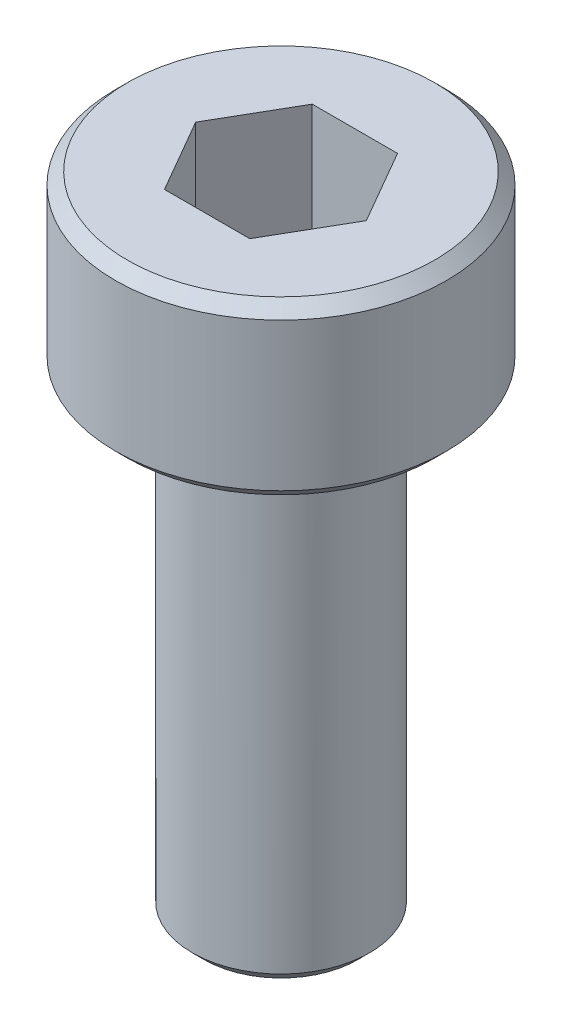
ISO-10303-21;
HEADER;
FILE_DESCRIPTION(('STEP AP214'),'2;1');
FILE_NAME('part.step','',(''),(''),'','','');
FILE_SCHEMA(('AUTOMOTIVE_DESIGN { 1 0 10303 214 1 1 1 1 }'));
ENDSEC;
DATA;
#1=APPLICATION_CONTEXT('core data for automotive mechanical design processes');
#2=APPLICATION_PROTOCOL_DEFINITION('international standard','automotive_design',2000,#1);
#3=PRODUCT_CONTEXT('',#1,'mechanical');
#4=PRODUCT('Part','Part','',(#3));
#5=PRODUCT_RELATED_PRODUCT_CATEGORY('part','',(#4));
#6=PRODUCT_DEFINITION_FORMATION('','',#4);
#7=PRODUCT_DEFINITION_CONTEXT('part definition',#1,'design');
#8=PRODUCT_DEFINITION('design','',#6,#7);
#9=PRODUCT_DEFINITION_SHAPE('','',#8);
#10=(LENGTH_UNIT() NAMED_UNIT(*) SI_UNIT(.MILLI.,.METRE.));
#11=(NAMED_UNIT(*) PLANE_ANGLE_UNIT() SI_UNIT($,.RADIAN.));
#12=(NAMED_UNIT(*) SI_UNIT($,.STERADIAN.) SOLID_ANGLE_UNIT());
#13=UNCERTAINTY_MEASURE_WITH_UNIT(LENGTH_MEASURE(1.E-05),#10,'distance_accuracy_value','');
#14=(GEOMETRIC_REPRESENTATION_CONTEXT(3) GLOBAL_UNCERTAINTY_ASSIGNED_CONTEXT((#13)) GLOBAL_UNIT_ASSIGNED_CONTEXT((#10,
#11,#12)) REPRESENTATION_CONTEXT('',''));
#15=CARTESIAN_POINT('',(0.,0.,0.));
#16=DIRECTION('',(0.,0.,1.));
#17=DIRECTION('',(1.,0.,0.));
#18=AXIS2_PLACEMENT_3D('',#15,#16,#17);
#19=CARTESIAN_POINT('',(0.721687836487033,8.9,1.25));
#20=DIRECTION('',(0.866025403784439,0.,0.5));
#21=DIRECTION('',(0.5,0.,-0.866025403784439));
#22=AXIS2_PLACEMENT_3D('',#19,#20,#21);
#23=PLANE('',#22);
#24=DIRECTION('',(0.5,0.,-0.866025403784439));
#25=VECTOR('',#24,1.);
#26=CARTESIAN_POINT('',(0.721687836487033,8.9,1.25));
#27=LINE('',#26,#25);
#28=CARTESIAN_POINT('',(0.721687836487033,8.9,1.25));
#29=VERTEX_POINT('',#28);
#30=CARTESIAN_POINT('',(1.44337567297407,8.9,0.));
#31=VERTEX_POINT('',#30);
#32=EDGE_CURVE('E66',#29,#31,#27,.T.);
#33=ORIENTED_EDGE('',*,*,#32,.F.);
#34=DIRECTION('',(0.,1.,0.));
#35=VECTOR('',#34,1.);
#36=CARTESIAN_POINT('',(0.721687836487033,8.9,1.25));
#37=LINE('',#36,#35);
#38=CARTESIAN_POINT('',(0.721687836487033,10.9,1.25));
#39=VERTEX_POINT('',#38);
#40=EDGE_CURVE('E86',#29,#39,#37,.T.);
#41=ORIENTED_EDGE('',*,*,#40,.T.);
#42=DIRECTION('',(0.5,0.,-0.866025403784439));
#43=VECTOR('',#42,1.);
#44=CARTESIAN_POINT('',(0.721687836487033,10.9,1.25));
#45=LINE('',#44,#43);
#46=CARTESIAN_POINT('',(1.44337567297406,10.9,0.));
#47=VERTEX_POINT('',#46);
#48=EDGE_CURVE('E74',#47,#39,#45,.F.);
#49=ORIENTED_EDGE('',*,*,#48,.F.);
#50=DIRECTION('',(0.,1.,0.));
#51=VECTOR('',#50,1.);
#52=CARTESIAN_POINT('',(1.44337567297406,8.9,0.));
#53=LINE('',#52,#51);
#54=EDGE_CURVE('E81',#47,#31,#53,.F.);
#55=ORIENTED_EDGE('',*,*,#54,.T.);
#56=EDGE_LOOP('',(#33,#41,#49,#55));
#57=FACE_BOUND('',#56,.T.);
#58=ADVANCED_FACE('F17',(#57),#23,.F.);
#59=CARTESIAN_POINT('',(1.44337567297406,8.9,0.));
#60=DIRECTION('',(0.866025403784438,0.,-0.5));
#61=DIRECTION('',(-0.5,0.,-0.866025403784438));
#62=AXIS2_PLACEMENT_3D('',#59,#60,#61);
#63=PLANE('',#62);
#64=DIRECTION('',(-0.5,0.,-0.866025403784438));
#65=VECTOR('',#64,1.);
#66=CARTESIAN_POINT('',(1.44337567297406,8.9,0.));
#67=LINE('',#66,#65);
#68=CARTESIAN_POINT('',(0.721687836487032,8.9,-1.25));
#69=VERTEX_POINT('',#68);
#70=EDGE_CURVE('E90',#31,#69,#67,.T.);
#71=ORIENTED_EDGE('',*,*,#70,.F.);
#72=ORIENTED_EDGE('',*,*,#54,.F.);
#73=DIRECTION('',(-0.5,0.,-0.866025403784438));
#74=VECTOR('',#73,1.);
#75=CARTESIAN_POINT('',(1.44337567297406,10.9,0.));
#76=LINE('',#75,#74);
#77=CARTESIAN_POINT('',(0.721687836487032,10.9,-1.25));
#78=VERTEX_POINT('',#77);
#79=EDGE_CURVE('E70',#78,#47,#76,.F.);
#80=ORIENTED_EDGE('',*,*,#79,.F.);
#81=DIRECTION('',(0.,1.,0.));
#82=VECTOR('',#81,1.);
#83=CARTESIAN_POINT('',(0.721687836487032,8.9,-1.25));
#84=LINE('',#83,#82);
#85=EDGE_CURVE('E134',#78,#69,#84,.F.);
#86=ORIENTED_EDGE('',*,*,#85,.T.);
#87=EDGE_LOOP('',(#71,#72,#80,#86));
#88=FACE_BOUND('',#87,.T.);
#89=ADVANCED_FACE('F89',(#88),#63,.F.);
#90=CARTESIAN_POINT('',(-0.721687836487032,8.9,1.25));
#91=DIRECTION('',(0.,0.,1.));
#92=DIRECTION('',(1.,0.,0.));
#93=AXIS2_PLACEMENT_3D('',#90,#91,#92);
#94=PLANE('',#93);
#95=DIRECTION('',(1.,0.,0.));
#96=VECTOR('',#95,1.);
#97=CARTESIAN_POINT('',(1.44337567297406,8.9,1.25));
#98=LINE('',#97,#96);
#99=CARTESIAN_POINT('',(-0.721687836487032,8.9,1.25));
#100=VERTEX_POINT('',#99);
#101=EDGE_CURVE('E132',#100,#29,#98,.T.);
#102=ORIENTED_EDGE('',*,*,#101,.F.);
#103=DIRECTION('',(0.,1.,0.));
#104=VECTOR('',#103,1.);
#105=CARTESIAN_POINT('',(-0.721687836487032,8.9,1.25));
#106=LINE('',#105,#104);
#107=CARTESIAN_POINT('',(-0.721687836487032,10.9,1.25));
#108=VERTEX_POINT('',#107);
#109=EDGE_CURVE('E122',#100,#108,#106,.T.);
#110=ORIENTED_EDGE('',*,*,#109,.T.);
#111=DIRECTION('',(1.,0.,0.));
#112=VECTOR('',#111,1.);
#113=CARTESIAN_POINT('',(-0.721687836487032,10.9,1.25));
#114=LINE('',#113,#112);
#115=EDGE_CURVE('E92',#39,#108,#114,.F.);
#116=ORIENTED_EDGE('',*,*,#115,.F.);
#117=ORIENTED_EDGE('',*,*,#40,.F.);
#118=EDGE_LOOP('',(#102,#110,#116,#117));
#119=FACE_BOUND('',#118,.T.);
#120=ADVANCED_FACE('F139',(#119),#94,.F.);
#121=CARTESIAN_POINT('',(0.721687836487032,8.9,-1.25));
#122=DIRECTION('',(0.,0.,-1.));
#123=DIRECTION('',(-1.,0.,0.));
#124=AXIS2_PLACEMENT_3D('',#121,#122,#123);
#125=PLANE('',#124);
#126=DIRECTION('',(1.,0.,0.));
#127=VECTOR('',#126,1.);
#128=CARTESIAN_POINT('',(1.44337567297406,8.9,-1.25));
#129=LINE('',#128,#127);
#130=CARTESIAN_POINT('',(-0.721687836487032,8.9,-1.25));
#131=VERTEX_POINT('',#130);
#132=EDGE_CURVE('E129',#69,#131,#129,.F.);
#133=ORIENTED_EDGE('',*,*,#132,.F.);
#134=ORIENTED_EDGE('',*,*,#85,.F.);
#135=DIRECTION('',(-1.,0.,0.));
#136=VECTOR('',#135,1.);
#137=CARTESIAN_POINT('',(0.721687836487032,10.9,-1.25));
#138=LINE('',#137,#136);
#139=CARTESIAN_POINT('',(-0.721687836487032,10.9,-1.25));
#140=VERTEX_POINT('',#139);
#141=EDGE_CURVE('E76',#140,#78,#138,.F.);
#142=ORIENTED_EDGE('',*,*,#141,.F.);
#143=DIRECTION('',(0.,1.,0.));
#144=VECTOR('',#143,1.);
#145=CARTESIAN_POINT('',(-0.721687836487032,8.9,-1.25));
#146=LINE('',#145,#144);
#147=EDGE_CURVE('E120',#140,#131,#146,.F.);
#148=ORIENTED_EDGE('',*,*,#147,.T.);
#149=EDGE_LOOP('',(#133,#134,#142,#148));
#150=FACE_BOUND('',#149,.T.);
#151=ADVANCED_FACE('F151',(#150),#125,.F.);
#152=CARTESIAN_POINT('',(1.44337567297406,8.9,0.));
#153=DIRECTION('',(0.,1.,0.));
#154=DIRECTION('',(0.,0.,1.));
#155=AXIS2_PLACEMENT_3D('',#152,#153,#154);
#156=PLANE('',#155);
#157=ORIENTED_EDGE('',*,*,#132,.T.);
#158=DIRECTION('',(-0.5,0.,0.866025403784439));
#159=VECTOR('',#158,1.);
#160=CARTESIAN_POINT('',(-0.721687836487032,8.9,-1.25));
#161=LINE('',#160,#159);
#162=CARTESIAN_POINT('',(-1.44337567297406,8.9,0.));
#163=VERTEX_POINT('',#162);
#164=EDGE_CURVE('E118',#131,#163,#161,.T.);
#165=ORIENTED_EDGE('',*,*,#164,.T.);
#166=DIRECTION('',(0.5,0.,0.866025403784438));
#167=VECTOR('',#166,1.);
#168=CARTESIAN_POINT('',(-1.44337567297406,8.9,0.));
#169=LINE('',#168,#167);
#170=EDGE_CURVE('E125',#163,#100,#169,.T.);
#171=ORIENTED_EDGE('',*,*,#170,.T.);
#172=ORIENTED_EDGE('',*,*,#101,.T.);
#173=ORIENTED_EDGE('',*,*,#32,.T.);
#174=ORIENTED_EDGE('',*,*,#70,.T.);
#175=EDGE_LOOP('',(#157,#165,#171,#172,#173,#174));
#176=FACE_BOUND('',#175,.T.);
#177=ADVANCED_FACE('F152',(#176),#156,.T.);
#178=CARTESIAN_POINT('',(-1.44337567297406,8.9,0.));
#179=DIRECTION('',(-0.866025403784438,0.,0.5));
#180=DIRECTION('',(0.5,0.,0.866025403784438));
#181=AXIS2_PLACEMENT_3D('',#178,#179,#180);
#182=PLANE('',#181);
#183=ORIENTED_EDGE('',*,*,#170,.F.);
#184=DIRECTION('',(0.,1.,0.));
#185=VECTOR('',#184,1.);
#186=CARTESIAN_POINT('',(-1.44337567297406,8.9,0.));
#187=LINE('',#186,#185);
#188=CARTESIAN_POINT('',(-1.44337567297406,10.9,0.));
#189=VERTEX_POINT('',#188);
#190=EDGE_CURVE('E116',#163,#189,#187,.T.);
#191=ORIENTED_EDGE('',*,*,#190,.T.);
#192=DIRECTION('',(0.5,0.,0.866025403784438));
#193=VECTOR('',#192,1.);
#194=CARTESIAN_POINT('',(-1.44337567297406,10.9,0.));
#195=LINE('',#194,#193);
#196=EDGE_CURVE('E35',#108,#189,#195,.F.);
#197=ORIENTED_EDGE('',*,*,#196,.F.);
#198=ORIENTED_EDGE('',*,*,#109,.F.);
#199=EDGE_LOOP('',(#183,#191,#197,#198));
#200=FACE_BOUND('',#199,.T.);
#201=ADVANCED_FACE('F142',(#200),#182,.F.);
#202=CARTESIAN_POINT('',(-0.721687836487032,8.9,-1.25));
#203=DIRECTION('',(-0.866025403784439,0.,-0.5));
#204=DIRECTION('',(-0.5,0.,0.866025403784439));
#205=AXIS2_PLACEMENT_3D('',#202,#203,#204);
#206=PLANE('',#205);
#207=ORIENTED_EDGE('',*,*,#164,.F.);
#208=ORIENTED_EDGE('',*,*,#147,.F.);
#209=DIRECTION('',(0.5,0.,-0.866025403784439));
#210=VECTOR('',#209,1.);
#211=CARTESIAN_POINT('',(-1.44337567297406,10.9,0.));
#212=LINE('',#211,#210);
#213=EDGE_CURVE('E114',#189,#140,#212,.T.);
#214=ORIENTED_EDGE('',*,*,#213,.F.);
#215=ORIENTED_EDGE('',*,*,#190,.F.);
#216=EDGE_LOOP('',(#207,#208,#214,#215));
#217=FACE_BOUND('',#216,.T.);
#218=ADVANCED_FACE('F148',(#217),#206,.F.);
#219=CARTESIAN_POINT('',(0.,10.9,-2.8));
#220=DIRECTION('',(0.,1.,0.));
#221=DIRECTION('',(0.,0.,1.));
#222=AXIS2_PLACEMENT_3D('',#219,#220,#221);
#223=PLANE('',#222);
#224=ORIENTED_EDGE('',*,*,#196,.T.);
#225=ORIENTED_EDGE('',*,*,#213,.T.);
#226=ORIENTED_EDGE('',*,*,#141,.T.);
#227=ORIENTED_EDGE('',*,*,#79,.T.);
#228=ORIENTED_EDGE('',*,*,#48,.T.);
#229=ORIENTED_EDGE('',*,*,#115,.T.);
#230=EDGE_LOOP('',(#224,#225,#226,#227,#228,#229));
#231=FACE_BOUND('',#230,.T.);
#232=CARTESIAN_POINT('',(0.,10.9000000000492,0.));
#233=DIRECTION('',(0.,-1.,0.));
#234=DIRECTION('',(0.,0.,-1.));
#235=AXIS2_PLACEMENT_3D('',#232,#233,#234);
#236=CIRCLE('',#235,2.59999999991578);
#237=CARTESIAN_POINT('',(0.,10.9000000000492,-2.59999999991578));
#238=VERTEX_POINT('',#237);
#239=EDGE_CURVE('E20',#238,#238,#236,.T.);
#240=ORIENTED_EDGE('',*,*,#239,.F.);
#241=EDGE_LOOP('',(#240));
#242=FACE_BOUND('',#241,.T.);
#243=ADVANCED_FACE('F72',(#231,#242),#223,.T.);
#244=CARTESIAN_POINT('',(0.,10.7000000001563,0.));
#245=DIRECTION('',(0.,-1.,0.));
#246=DIRECTION('',(0.,0.,-1.));
#247=AXIS2_PLACEMENT_3D('',#244,#245,#246);
#248=CONICAL_SURFACE('',#247,2.79999999980873,0.785398163397448);
#249=CARTESIAN_POINT('',(0.,10.7,0.));
#250=DIRECTION('',(0.,-1.,0.));
#251=DIRECTION('',(0.,0.,-1.));
#252=AXIS2_PLACEMENT_3D('',#249,#250,#251);
#253=CIRCLE('',#252,2.8);
#254=CARTESIAN_POINT('',(0.,10.7,-2.8));
#255=VERTEX_POINT('',#254);
#256=EDGE_CURVE('E107',#255,#255,#253,.T.);
#257=ORIENTED_EDGE('',*,*,#256,.F.);
#258=EDGE_LOOP('',(#257));
#259=FACE_BOUND('',#258,.T.);
#260=ORIENTED_EDGE('',*,*,#239,.T.);
#261=EDGE_LOOP('',(#260));
#262=FACE_BOUND('',#261,.T.);
#263=ADVANCED_FACE('F187',(#259,#262),#248,.T.);
#264=CARTESIAN_POINT('',(0.,0.,0.));
#265=DIRECTION('',(0.,-1.,0.));
#266=DIRECTION('',(0.,0.,-1.));
#267=AXIS2_PLACEMENT_3D('',#264,#265,#266);
#268=CYLINDRICAL_SURFACE('',#267,2.8);
#269=CARTESIAN_POINT('',(0.,8.19999999998799,0.));
#270=DIRECTION('',(0.,1.,0.));
#271=DIRECTION('',(0.,0.,1.));
#272=AXIS2_PLACEMENT_3D('',#269,#270,#271);
#273=CIRCLE('',#272,2.80000000003611);
#274=CARTESIAN_POINT('',(0.,8.19999999998799,2.80000000003611));
#275=VERTEX_POINT('',#274);
#276=EDGE_CURVE('E103',#275,#275,#273,.F.);
#277=ORIENTED_EDGE('',*,*,#276,.F.);
#278=EDGE_LOOP('',(#277));
#279=FACE_BOUND('',#278,.T.);
#280=ORIENTED_EDGE('',*,*,#256,.T.);
#281=EDGE_LOOP('',(#280));
#282=FACE_BOUND('',#281,.T.);
#283=ADVANCED_FACE('F184',(#279,#282),#268,.T.);
#284=CARTESIAN_POINT('',(0.,8.19999999993115,0.));
#285=DIRECTION('',(0.,1.,0.));
#286=DIRECTION('',(0.,0.,1.));
#287=AXIS2_PLACEMENT_3D('',#284,#285,#286);
#288=CONICAL_SURFACE('',#287,2.79999999992242,0.78539816325534);
#289=ORIENTED_EDGE('',*,*,#276,.T.);
#290=EDGE_LOOP('',(#289));
#291=FACE_BOUND('',#290,.T.);
#292=CARTESIAN_POINT('',(0.,7.99999999992451,0.));
#293=DIRECTION('',(0.,1.,0.));
#294=DIRECTION('',(0.,0.,1.));
#295=AXIS2_PLACEMENT_3D('',#292,#293,#294);
#296=CIRCLE('',#295,2.59999999997262);
#297=CARTESIAN_POINT('',(0.,7.99999999992451,2.59999999997262));
#298=VERTEX_POINT('',#297);
#299=EDGE_CURVE('E101',#298,#298,#296,.F.);
#300=ORIENTED_EDGE('',*,*,#299,.F.);
#301=EDGE_LOOP('',(#300));
#302=FACE_BOUND('',#301,.T.);
#303=ADVANCED_FACE('F180',(#291,#302),#288,.T.);
#304=CARTESIAN_POINT('',(0.,0.,0.));
#305=DIRECTION('',(0.,-1.,0.));
#306=DIRECTION('',(0.,0.,-1.));
#307=AXIS2_PLACEMENT_3D('',#304,#305,#306);
#308=PLANE('',#307);
#309=CARTESIAN_POINT('',(0.,0.,0.));
#310=DIRECTION('',(0.,1.,0.));
#311=DIRECTION('',(0.,0.,1.));
#312=AXIS2_PLACEMENT_3D('',#309,#310,#311);
#313=CIRCLE('',#312,1.30000000001473);
#314=CARTESIAN_POINT('',(0.,0.,1.30000000001473));
#315=VERTEX_POINT('',#314);
#316=EDGE_CURVE('E99',#315,#315,#313,.T.);
#317=ORIENTED_EDGE('',*,*,#316,.F.);
#318=EDGE_LOOP('',(#317));
#319=FACE_BOUND('',#318,.T.);
#320=ADVANCED_FACE('F177',(#319),#308,.T.);
#321=CARTESIAN_POINT('',(0.,8.,-1.5));
#322=DIRECTION('',(0.,-1.,0.));
#323=DIRECTION('',(0.,0.,-1.));
#324=AXIS2_PLACEMENT_3D('',#321,#322,#323);
#325=PLANE('',#324);
#326=ORIENTED_EDGE('',*,*,#299,.T.);
#327=EDGE_LOOP('',(#326));
#328=FACE_BOUND('',#327,.T.);
#329=CARTESIAN_POINT('',(0.,8.,0.));
#330=DIRECTION('',(0.,-1.,0.));
#331=DIRECTION('',(0.,0.,-1.));
#332=AXIS2_PLACEMENT_3D('',#329,#330,#331);
#333=CIRCLE('',#332,1.5);
#334=CARTESIAN_POINT('',(0.,8.,-1.5));
#335=VERTEX_POINT('',#334);
#336=EDGE_CURVE('E26',#335,#335,#333,.T.);
#337=ORIENTED_EDGE('',*,*,#336,.F.);
#338=EDGE_LOOP('',(#337));
#339=FACE_BOUND('',#338,.T.);
#340=ADVANCED_FACE('F170',(#328,#339),#325,.T.);
#341=CARTESIAN_POINT('',(0.,0.200000000006639,0.));
#342=DIRECTION('',(0.,1.,0.));
#343=DIRECTION('',(0.,0.,1.));
#344=AXIS2_PLACEMENT_3D('',#341,#342,#343);
#345=CONICAL_SURFACE('',#344,1.50000000007822,0.785398163539557);
#346=CARTESIAN_POINT('',(0.,0.200000000000001,0.));
#347=DIRECTION('',(0.,-1.,0.));
#348=DIRECTION('',(0.,0.,-1.));
#349=AXIS2_PLACEMENT_3D('',#346,#347,#348);
#350=CIRCLE('',#349,1.5);
#351=CARTESIAN_POINT('',(0.,0.200000000000001,-1.5));
#352=VERTEX_POINT('',#351);
#353=EDGE_CURVE('E11',#352,#352,#350,.F.);
#354=ORIENTED_EDGE('',*,*,#353,.F.);
#355=EDGE_LOOP('',(#354));
#356=FACE_BOUND('',#355,.T.);
#357=ORIENTED_EDGE('',*,*,#316,.T.);
#358=EDGE_LOOP('',(#357));
#359=FACE_BOUND('',#358,.T.);
#360=ADVANCED_FACE('F164',(#356,#359),#345,.T.);
#361=CARTESIAN_POINT('',(0.,0.,0.));
#362=DIRECTION('',(0.,-1.,0.));
#363=DIRECTION('',(0.,0.,-1.));
#364=AXIS2_PLACEMENT_3D('',#361,#362,#363);
#365=CYLINDRICAL_SURFACE('',#364,1.5);
#366=ORIENTED_EDGE('',*,*,#353,.T.);
#367=EDGE_LOOP('',(#366));
#368=FACE_BOUND('',#367,.T.);
#369=ORIENTED_EDGE('',*,*,#336,.T.);
#370=EDGE_LOOP('',(#369));
#371=FACE_BOUND('',#370,.T.);
#372=ADVANCED_FACE('F162',(#368,#371),#365,.T.);
#373=CLOSED_SHELL('',(#58,#89,#120,#151,#177,#201,#218,#243,#263,#283,#303,#320,#340,#360,#372));
#374=MANIFOLD_SOLID_BREP('B1',#373);
#375=ADVANCED_BREP_SHAPE_REPRESENTATION('',(#18,#374),#14);
#376=SHAPE_DEFINITION_REPRESENTATION(#9,#375);
ENDSEC;
END-ISO-10303-21;
